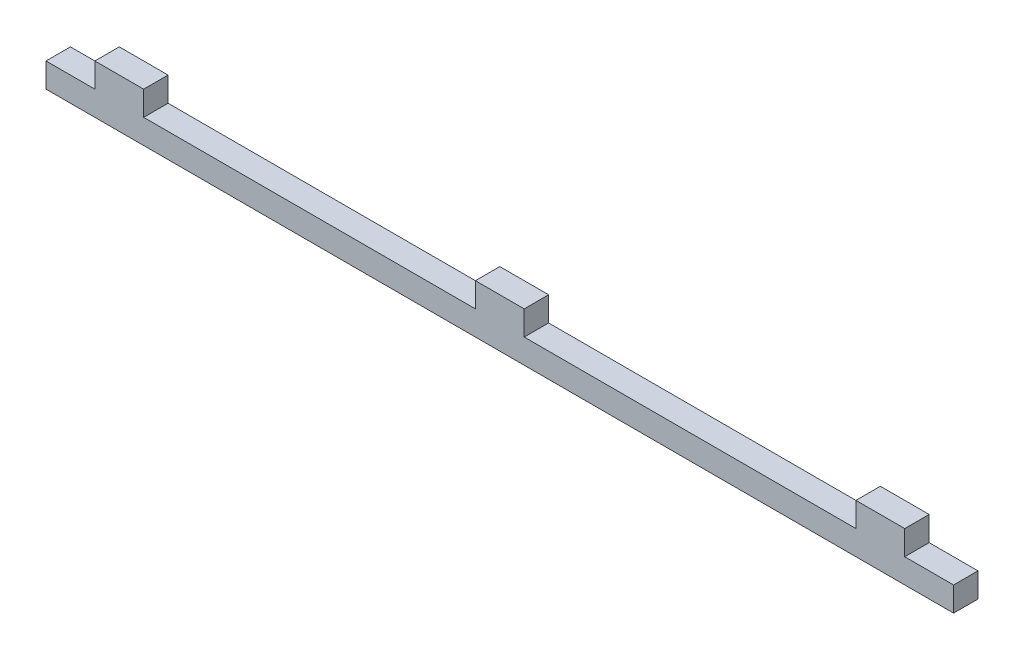
ISO-10303-21;
HEADER;
FILE_DESCRIPTION(('STEP AP214'),'2;1');
FILE_NAME('part.step','',(''),(''),'','','');
FILE_SCHEMA(('AUTOMOTIVE_DESIGN { 1 0 10303 214 1 1 1 1 }'));
ENDSEC;
DATA;
#1=APPLICATION_CONTEXT('core data for automotive mechanical design processes');
#2=APPLICATION_PROTOCOL_DEFINITION('international standard','automotive_design',2000,#1);
#3=PRODUCT_CONTEXT('',#1,'mechanical');
#4=PRODUCT('Part','Part','',(#3));
#5=PRODUCT_RELATED_PRODUCT_CATEGORY('part','',(#4));
#6=PRODUCT_DEFINITION_FORMATION('','',#4);
#7=PRODUCT_DEFINITION_CONTEXT('part definition',#1,'design');
#8=PRODUCT_DEFINITION('design','',#6,#7);
#9=PRODUCT_DEFINITION_SHAPE('','',#8);
#10=(LENGTH_UNIT() NAMED_UNIT(*) SI_UNIT(.MILLI.,.METRE.));
#11=(NAMED_UNIT(*) PLANE_ANGLE_UNIT() SI_UNIT($,.RADIAN.));
#12=(NAMED_UNIT(*) SI_UNIT($,.STERADIAN.) SOLID_ANGLE_UNIT());
#13=UNCERTAINTY_MEASURE_WITH_UNIT(LENGTH_MEASURE(1.E-05),#10,'distance_accuracy_value','');
#14=(GEOMETRIC_REPRESENTATION_CONTEXT(3) GLOBAL_UNCERTAINTY_ASSIGNED_CONTEXT((#13)) GLOBAL_UNIT_ASSIGNED_CONTEXT((#10,
#11,#12)) REPRESENTATION_CONTEXT('',''));
#15=CARTESIAN_POINT('',(0.,0.,0.));
#16=DIRECTION('',(0.,0.,1.));
#17=DIRECTION('',(1.,0.,0.));
#18=AXIS2_PLACEMENT_3D('',#15,#16,#17);
#19=CARTESIAN_POINT('',(-99.4999999999998,0.,-6.));
#20=DIRECTION('',(1.,0.,0.));
#21=DIRECTION('',(0.,0.,-1.));
#22=AXIS2_PLACEMENT_3D('',#19,#20,#21);
#23=PLANE('',#22);
#24=DIRECTION('',(0.,1.,0.));
#25=VECTOR('',#24,1.);
#26=CARTESIAN_POINT('',(-99.4999999999998,0.,0.));
#27=LINE('',#26,#25);
#28=CARTESIAN_POINT('',(-99.4999999999998,3.,0.));
#29=VERTEX_POINT('',#28);
#30=CARTESIAN_POINT('',(-99.4999999999998,9.,0.));
#31=VERTEX_POINT('',#30);
#32=EDGE_CURVE('E184',#29,#31,#27,.T.);
#33=ORIENTED_EDGE('',*,*,#32,.T.);
#34=DIRECTION('',(0.,0.,1.));
#35=VECTOR('',#34,1.);
#36=CARTESIAN_POINT('',(-99.4999999999998,9.,-6.));
#37=LINE('',#36,#35);
#38=CARTESIAN_POINT('',(-99.4999999999998,9.,-6.));
#39=VERTEX_POINT('',#38);
#40=EDGE_CURVE('E11',#39,#31,#37,.T.);
#41=ORIENTED_EDGE('',*,*,#40,.F.);
#42=DIRECTION('',(0.,1.,0.));
#43=VECTOR('',#42,1.);
#44=CARTESIAN_POINT('',(-99.4999999999998,0.,-6.));
#45=LINE('',#44,#43);
#46=CARTESIAN_POINT('',(-99.4999999999998,3.,-6.));
#47=VERTEX_POINT('',#46);
#48=EDGE_CURVE('E217',#47,#39,#45,.T.);
#49=ORIENTED_EDGE('',*,*,#48,.F.);
#50=DIRECTION('',(0.,0.,1.));
#51=VECTOR('',#50,1.);
#52=CARTESIAN_POINT('',(-99.4999999999998,3.,-6.));
#53=LINE('',#52,#51);
#54=EDGE_CURVE('E44',#47,#29,#53,.T.);
#55=ORIENTED_EDGE('',*,*,#54,.T.);
#56=EDGE_LOOP('',(#33,#41,#49,#55));
#57=FACE_BOUND('',#56,.T.);
#58=ADVANCED_FACE('F41',(#57),#23,.F.);
#59=CARTESIAN_POINT('',(0.,9.,-6.));
#60=DIRECTION('',(0.,-1.,0.));
#61=DIRECTION('',(0.,0.,-1.));
#62=AXIS2_PLACEMENT_3D('',#59,#60,#61);
#63=PLANE('',#62);
#64=DIRECTION('',(1.,0.,0.));
#65=VECTOR('',#64,1.);
#66=CARTESIAN_POINT('',(0.,9.,0.));
#67=LINE('',#66,#65);
#68=CARTESIAN_POINT('',(-87.4999999999998,9.,0.));
#69=VERTEX_POINT('',#68);
#70=EDGE_CURVE('E116',#31,#69,#67,.T.);
#71=ORIENTED_EDGE('',*,*,#70,.T.);
#72=DIRECTION('',(0.,0.,1.));
#73=VECTOR('',#72,1.);
#74=CARTESIAN_POINT('',(-87.4999999999998,9.,-6.));
#75=LINE('',#74,#73);
#76=CARTESIAN_POINT('',(-87.4999999999998,9.,-6.));
#77=VERTEX_POINT('',#76);
#78=EDGE_CURVE('E50',#77,#69,#75,.T.);
#79=ORIENTED_EDGE('',*,*,#78,.F.);
#80=DIRECTION('',(1.,0.,0.));
#81=VECTOR('',#80,1.);
#82=CARTESIAN_POINT('',(0.,9.,-6.));
#83=LINE('',#82,#81);
#84=EDGE_CURVE('E58',#39,#77,#83,.T.);
#85=ORIENTED_EDGE('',*,*,#84,.F.);
#86=ORIENTED_EDGE('',*,*,#40,.T.);
#87=EDGE_LOOP('',(#71,#79,#85,#86));
#88=FACE_BOUND('',#87,.T.);
#89=ADVANCED_FACE('F277',(#88),#63,.F.);
#90=CARTESIAN_POINT('',(-87.4999999999998,0.,-6.));
#91=DIRECTION('',(1.,0.,0.));
#92=DIRECTION('',(0.,0.,-1.));
#93=AXIS2_PLACEMENT_3D('',#90,#91,#92);
#94=PLANE('',#93);
#95=DIRECTION('',(0.,1.,0.));
#96=VECTOR('',#95,1.);
#97=CARTESIAN_POINT('',(-87.4999999999998,0.,0.));
#98=LINE('',#97,#96);
#99=CARTESIAN_POINT('',(-87.4999999999998,3.,0.));
#100=VERTEX_POINT('',#99);
#101=EDGE_CURVE('E165',#100,#69,#98,.T.);
#102=ORIENTED_EDGE('',*,*,#101,.F.);
#103=DIRECTION('',(0.,0.,1.));
#104=VECTOR('',#103,1.);
#105=CARTESIAN_POINT('',(-87.4999999999998,3.,-6.));
#106=LINE('',#105,#104);
#107=CARTESIAN_POINT('',(-87.4999999999998,3.,-6.));
#108=VERTEX_POINT('',#107);
#109=EDGE_CURVE('E160',#108,#100,#106,.T.);
#110=ORIENTED_EDGE('',*,*,#109,.F.);
#111=DIRECTION('',(0.,1.,0.));
#112=VECTOR('',#111,1.);
#113=CARTESIAN_POINT('',(-87.4999999999998,0.,-6.));
#114=LINE('',#113,#112);
#115=EDGE_CURVE('E164',#108,#77,#114,.T.);
#116=ORIENTED_EDGE('',*,*,#115,.T.);
#117=ORIENTED_EDGE('',*,*,#78,.T.);
#118=EDGE_LOOP('',(#102,#110,#116,#117));
#119=FACE_BOUND('',#118,.T.);
#120=ADVANCED_FACE('F162',(#119),#94,.T.);
#121=CARTESIAN_POINT('',(0.,3.,-6.));
#122=DIRECTION('',(0.,-1.,0.));
#123=DIRECTION('',(0.,0.,-1.));
#124=AXIS2_PLACEMENT_3D('',#121,#122,#123);
#125=PLANE('',#124);
#126=DIRECTION('',(1.,0.,0.));
#127=VECTOR('',#126,1.);
#128=CARTESIAN_POINT('',(0.,3.,0.));
#129=LINE('',#128,#127);
#130=CARTESIAN_POINT('',(-5.99999999999994,3.,0.));
#131=VERTEX_POINT('',#130);
#132=EDGE_CURVE('E190',#100,#131,#129,.T.);
#133=ORIENTED_EDGE('',*,*,#132,.T.);
#134=DIRECTION('',(0.,0.,1.));
#135=VECTOR('',#134,1.);
#136=CARTESIAN_POINT('',(-5.99999999999994,3.,-6.));
#137=LINE('',#136,#135);
#138=CARTESIAN_POINT('',(-5.99999999999994,3.,-6.));
#139=VERTEX_POINT('',#138);
#140=EDGE_CURVE('E168',#139,#131,#137,.T.);
#141=ORIENTED_EDGE('',*,*,#140,.F.);
#142=DIRECTION('',(1.,0.,0.));
#143=VECTOR('',#142,1.);
#144=CARTESIAN_POINT('',(0.,3.,-6.));
#145=LINE('',#144,#143);
#146=EDGE_CURVE('E171',#108,#139,#145,.T.);
#147=ORIENTED_EDGE('',*,*,#146,.F.);
#148=ORIENTED_EDGE('',*,*,#109,.T.);
#149=EDGE_LOOP('',(#133,#141,#147,#148));
#150=FACE_BOUND('',#149,.T.);
#151=ADVANCED_FACE('F172',(#150),#125,.F.);
#152=CARTESIAN_POINT('',(-5.99999999999994,0.,-6.));
#153=DIRECTION('',(1.,0.,0.));
#154=DIRECTION('',(0.,0.,-1.));
#155=AXIS2_PLACEMENT_3D('',#152,#153,#154);
#156=PLANE('',#155);
#157=DIRECTION('',(0.,1.,0.));
#158=VECTOR('',#157,1.);
#159=CARTESIAN_POINT('',(-5.99999999999994,0.,0.));
#160=LINE('',#159,#158);
#161=CARTESIAN_POINT('',(-5.99999999999994,9.,0.));
#162=VERTEX_POINT('',#161);
#163=EDGE_CURVE('E214',#131,#162,#160,.T.);
#164=ORIENTED_EDGE('',*,*,#163,.T.);
#165=DIRECTION('',(0.,0.,1.));
#166=VECTOR('',#165,1.);
#167=CARTESIAN_POINT('',(-5.99999999999994,9.,-6.));
#168=LINE('',#167,#166);
#169=CARTESIAN_POINT('',(-5.99999999999994,9.,-6.));
#170=VERTEX_POINT('',#169);
#171=EDGE_CURVE('E221',#170,#162,#168,.T.);
#172=ORIENTED_EDGE('',*,*,#171,.F.);
#173=DIRECTION('',(0.,1.,0.));
#174=VECTOR('',#173,1.);
#175=CARTESIAN_POINT('',(-5.99999999999994,0.,-6.));
#176=LINE('',#175,#174);
#177=EDGE_CURVE('E175',#139,#170,#176,.T.);
#178=ORIENTED_EDGE('',*,*,#177,.F.);
#179=ORIENTED_EDGE('',*,*,#140,.T.);
#180=EDGE_LOOP('',(#164,#172,#178,#179));
#181=FACE_BOUND('',#180,.T.);
#182=ADVANCED_FACE('F275',(#181),#156,.F.);
#183=CARTESIAN_POINT('',(0.,9.,-6.));
#184=DIRECTION('',(0.,-1.,0.));
#185=DIRECTION('',(0.,0.,-1.));
#186=AXIS2_PLACEMENT_3D('',#183,#184,#185);
#187=PLANE('',#186);
#188=DIRECTION('',(1.,0.,0.));
#189=VECTOR('',#188,1.);
#190=CARTESIAN_POINT('',(0.,9.,0.));
#191=LINE('',#190,#189);
#192=CARTESIAN_POINT('',(6.00000000000005,9.,0.));
#193=VERTEX_POINT('',#192);
#194=EDGE_CURVE('E211',#162,#193,#191,.T.);
#195=ORIENTED_EDGE('',*,*,#194,.T.);
#196=DIRECTION('',(0.,0.,1.));
#197=VECTOR('',#196,1.);
#198=CARTESIAN_POINT('',(6.00000000000005,9.,-6.));
#199=LINE('',#198,#197);
#200=CARTESIAN_POINT('',(6.00000000000005,9.,-6.));
#201=VERTEX_POINT('',#200);
#202=EDGE_CURVE('E224',#201,#193,#199,.T.);
#203=ORIENTED_EDGE('',*,*,#202,.F.);
#204=DIRECTION('',(1.,0.,0.));
#205=VECTOR('',#204,1.);
#206=CARTESIAN_POINT('',(0.,9.,-6.));
#207=LINE('',#206,#205);
#208=EDGE_CURVE('E513',#170,#201,#207,.T.);
#209=ORIENTED_EDGE('',*,*,#208,.F.);
#210=ORIENTED_EDGE('',*,*,#171,.T.);
#211=EDGE_LOOP('',(#195,#203,#209,#210));
#212=FACE_BOUND('',#211,.T.);
#213=ADVANCED_FACE('F388',(#212),#187,.F.);
#214=CARTESIAN_POINT('',(6.00000000000005,0.,-6.));
#215=DIRECTION('',(1.,0.,0.));
#216=DIRECTION('',(0.,0.,-1.));
#217=AXIS2_PLACEMENT_3D('',#214,#215,#216);
#218=PLANE('',#217);
#219=DIRECTION('',(0.,1.,0.));
#220=VECTOR('',#219,1.);
#221=CARTESIAN_POINT('',(6.00000000000005,0.,0.));
#222=LINE('',#221,#220);
#223=CARTESIAN_POINT('',(6.00000000000005,3.,0.));
#224=VERTEX_POINT('',#223);
#225=EDGE_CURVE('E208',#224,#193,#222,.T.);
#226=ORIENTED_EDGE('',*,*,#225,.F.);
#227=DIRECTION('',(0.,0.,1.));
#228=VECTOR('',#227,1.);
#229=CARTESIAN_POINT('',(6.00000000000005,3.,-6.));
#230=LINE('',#229,#228);
#231=CARTESIAN_POINT('',(6.00000000000005,3.,-6.));
#232=VERTEX_POINT('',#231);
#233=EDGE_CURVE('E226',#232,#224,#230,.T.);
#234=ORIENTED_EDGE('',*,*,#233,.F.);
#235=DIRECTION('',(0.,1.,0.));
#236=VECTOR('',#235,1.);
#237=CARTESIAN_POINT('',(6.00000000000005,0.,-6.));
#238=LINE('',#237,#236);
#239=EDGE_CURVE('E520',#232,#201,#238,.T.);
#240=ORIENTED_EDGE('',*,*,#239,.T.);
#241=ORIENTED_EDGE('',*,*,#202,.T.);
#242=EDGE_LOOP('',(#226,#234,#240,#241));
#243=FACE_BOUND('',#242,.T.);
#244=ADVANCED_FACE('F378',(#243),#218,.T.);
#245=CARTESIAN_POINT('',(87.5000000000001,3.,0.));
#246=VERTEX_POINT('',#245);
#247=EDGE_CURVE('E207',#224,#246,#129,.T.);
#248=ORIENTED_EDGE('',*,*,#247,.T.);
#249=DIRECTION('',(0.,0.,1.));
#250=VECTOR('',#249,1.);
#251=CARTESIAN_POINT('',(87.5000000000001,3.,-6.));
#252=LINE('',#251,#250);
#253=CARTESIAN_POINT('',(87.5000000000001,3.,-6.));
#254=VERTEX_POINT('',#253);
#255=EDGE_CURVE('E228',#254,#246,#252,.T.);
#256=ORIENTED_EDGE('',*,*,#255,.F.);
#257=EDGE_CURVE('E177',#232,#254,#145,.T.);
#258=ORIENTED_EDGE('',*,*,#257,.F.);
#259=ORIENTED_EDGE('',*,*,#233,.T.);
#260=EDGE_LOOP('',(#248,#256,#258,#259));
#261=FACE_BOUND('',#260,.T.);
#262=ADVANCED_FACE('F273',(#261),#125,.F.);
#263=CARTESIAN_POINT('',(87.5000000000001,0.,-6.));
#264=DIRECTION('',(1.,0.,0.));
#265=DIRECTION('',(0.,0.,-1.));
#266=AXIS2_PLACEMENT_3D('',#263,#264,#265);
#267=PLANE('',#266);
#268=DIRECTION('',(0.,1.,0.));
#269=VECTOR('',#268,1.);
#270=CARTESIAN_POINT('',(87.5000000000001,0.,0.));
#271=LINE('',#270,#269);
#272=CARTESIAN_POINT('',(87.5000000000001,9.,0.));
#273=VERTEX_POINT('',#272);
#274=EDGE_CURVE('E205',#246,#273,#271,.T.);
#275=ORIENTED_EDGE('',*,*,#274,.T.);
#276=DIRECTION('',(0.,0.,1.));
#277=VECTOR('',#276,1.);
#278=CARTESIAN_POINT('',(87.5000000000001,9.,-6.));
#279=LINE('',#278,#277);
#280=CARTESIAN_POINT('',(87.5000000000001,9.,-6.));
#281=VERTEX_POINT('',#280);
#282=EDGE_CURVE('E231',#281,#273,#279,.T.);
#283=ORIENTED_EDGE('',*,*,#282,.F.);
#284=DIRECTION('',(0.,1.,0.));
#285=VECTOR('',#284,1.);
#286=CARTESIAN_POINT('',(87.5000000000001,0.,-6.));
#287=LINE('',#286,#285);
#288=EDGE_CURVE('E522',#254,#281,#287,.T.);
#289=ORIENTED_EDGE('',*,*,#288,.F.);
#290=ORIENTED_EDGE('',*,*,#255,.T.);
#291=EDGE_LOOP('',(#275,#283,#289,#290));
#292=FACE_BOUND('',#291,.T.);
#293=ADVANCED_FACE('F357',(#292),#267,.F.);
#294=CARTESIAN_POINT('',(0.,9.,-6.));
#295=DIRECTION('',(0.,-1.,0.));
#296=DIRECTION('',(0.,0.,-1.));
#297=AXIS2_PLACEMENT_3D('',#294,#295,#296);
#298=PLANE('',#297);
#299=DIRECTION('',(1.,0.,0.));
#300=VECTOR('',#299,1.);
#301=CARTESIAN_POINT('',(0.,9.,0.));
#302=LINE('',#301,#300);
#303=CARTESIAN_POINT('',(99.5000000000001,9.,0.));
#304=VERTEX_POINT('',#303);
#305=EDGE_CURVE('E202',#273,#304,#302,.T.);
#306=ORIENTED_EDGE('',*,*,#305,.T.);
#307=DIRECTION('',(0.,0.,1.));
#308=VECTOR('',#307,1.);
#309=CARTESIAN_POINT('',(99.5000000000001,9.,-6.));
#310=LINE('',#309,#308);
#311=CARTESIAN_POINT('',(99.5000000000001,9.,-6.));
#312=VERTEX_POINT('',#311);
#313=EDGE_CURVE('E234',#312,#304,#310,.T.);
#314=ORIENTED_EDGE('',*,*,#313,.F.);
#315=DIRECTION('',(1.,0.,0.));
#316=VECTOR('',#315,1.);
#317=CARTESIAN_POINT('',(0.,9.,-6.));
#318=LINE('',#317,#316);
#319=EDGE_CURVE('E526',#281,#312,#318,.T.);
#320=ORIENTED_EDGE('',*,*,#319,.F.);
#321=ORIENTED_EDGE('',*,*,#282,.T.);
#322=EDGE_LOOP('',(#306,#314,#320,#321));
#323=FACE_BOUND('',#322,.T.);
#324=ADVANCED_FACE('F345',(#323),#298,.F.);
#325=CARTESIAN_POINT('',(99.5000000000001,0.,-6.));
#326=DIRECTION('',(1.,0.,0.));
#327=DIRECTION('',(0.,0.,-1.));
#328=AXIS2_PLACEMENT_3D('',#325,#326,#327);
#329=PLANE('',#328);
#330=DIRECTION('',(0.,1.,0.));
#331=VECTOR('',#330,1.);
#332=CARTESIAN_POINT('',(99.5000000000001,0.,0.));
#333=LINE('',#332,#331);
#334=CARTESIAN_POINT('',(99.5000000000001,3.,0.));
#335=VERTEX_POINT('',#334);
#336=EDGE_CURVE('E199',#335,#304,#333,.T.);
#337=ORIENTED_EDGE('',*,*,#336,.F.);
#338=DIRECTION('',(0.,0.,1.));
#339=VECTOR('',#338,1.);
#340=CARTESIAN_POINT('',(99.5000000000001,3.,-6.));
#341=LINE('',#340,#339);
#342=CARTESIAN_POINT('',(99.5000000000001,3.,-6.));
#343=VERTEX_POINT('',#342);
#344=EDGE_CURVE('E236',#343,#335,#341,.T.);
#345=ORIENTED_EDGE('',*,*,#344,.F.);
#346=DIRECTION('',(0.,1.,0.));
#347=VECTOR('',#346,1.);
#348=CARTESIAN_POINT('',(99.5000000000001,0.,-6.));
#349=LINE('',#348,#347);
#350=EDGE_CURVE('E528',#343,#312,#349,.T.);
#351=ORIENTED_EDGE('',*,*,#350,.T.);
#352=ORIENTED_EDGE('',*,*,#313,.T.);
#353=EDGE_LOOP('',(#337,#345,#351,#352));
#354=FACE_BOUND('',#353,.T.);
#355=ADVANCED_FACE('F271',(#354),#329,.T.);
#356=CARTESIAN_POINT('',(111.5,3.,0.));
#357=VERTEX_POINT('',#356);
#358=EDGE_CURVE('E191',#335,#357,#129,.T.);
#359=ORIENTED_EDGE('',*,*,#358,.T.);
#360=DIRECTION('',(0.,0.,1.));
#361=VECTOR('',#360,1.);
#362=CARTESIAN_POINT('',(111.5,3.,-6.));
#363=LINE('',#362,#361);
#364=CARTESIAN_POINT('',(111.5,3.,-6.));
#365=VERTEX_POINT('',#364);
#366=EDGE_CURVE('E238',#365,#357,#363,.T.);
#367=ORIENTED_EDGE('',*,*,#366,.F.);
#368=EDGE_CURVE('E523',#343,#365,#145,.T.);
#369=ORIENTED_EDGE('',*,*,#368,.F.);
#370=ORIENTED_EDGE('',*,*,#344,.T.);
#371=EDGE_LOOP('',(#359,#367,#369,#370));
#372=FACE_BOUND('',#371,.T.);
#373=ADVANCED_FACE('F259',(#372),#125,.F.);
#374=CARTESIAN_POINT('',(111.5,0.,-6.));
#375=DIRECTION('',(1.,0.,0.));
#376=DIRECTION('',(0.,0.,-1.));
#377=AXIS2_PLACEMENT_3D('',#374,#375,#376);
#378=PLANE('',#377);
#379=DIRECTION('',(0.,1.,0.));
#380=VECTOR('',#379,1.);
#381=CARTESIAN_POINT('',(111.5,0.,0.));
#382=LINE('',#381,#380);
#383=CARTESIAN_POINT('',(111.5,-3.,0.));
#384=VERTEX_POINT('',#383);
#385=EDGE_CURVE('E196',#384,#357,#382,.T.);
#386=ORIENTED_EDGE('',*,*,#385,.F.);
#387=DIRECTION('',(0.,0.,1.));
#388=VECTOR('',#387,1.);
#389=CARTESIAN_POINT('',(111.5,-3.,-6.));
#390=LINE('',#389,#388);
#391=CARTESIAN_POINT('',(111.5,-3.,-6.));
#392=VERTEX_POINT('',#391);
#393=EDGE_CURVE('E240',#392,#384,#390,.T.);
#394=ORIENTED_EDGE('',*,*,#393,.F.);
#395=DIRECTION('',(0.,1.,0.));
#396=VECTOR('',#395,1.);
#397=CARTESIAN_POINT('',(111.5,0.,-6.));
#398=LINE('',#397,#396);
#399=EDGE_CURVE('E531',#392,#365,#398,.T.);
#400=ORIENTED_EDGE('',*,*,#399,.T.);
#401=ORIENTED_EDGE('',*,*,#366,.T.);
#402=EDGE_LOOP('',(#386,#394,#400,#401));
#403=FACE_BOUND('',#402,.T.);
#404=ADVANCED_FACE('F270',(#403),#378,.T.);
#405=CARTESIAN_POINT('',(0.,-3.,-6.));
#406=DIRECTION('',(0.,-1.,0.));
#407=DIRECTION('',(1.,0.,0.));
#408=AXIS2_PLACEMENT_3D('',#405,#406,#407);
#409=PLANE('',#408);
#410=DIRECTION('',(1.,0.,0.));
#411=VECTOR('',#410,1.);
#412=CARTESIAN_POINT('',(0.,-3.,0.));
#413=LINE('',#412,#411);
#414=CARTESIAN_POINT('',(-111.5,-3.,0.));
#415=VERTEX_POINT('',#414);
#416=EDGE_CURVE('E193',#415,#384,#413,.T.);
#417=ORIENTED_EDGE('',*,*,#416,.F.);
#418=DIRECTION('',(0.,0.,1.));
#419=VECTOR('',#418,1.);
#420=CARTESIAN_POINT('',(-111.5,-3.,-6.));
#421=LINE('',#420,#419);
#422=CARTESIAN_POINT('',(-111.5,-3.,-6.));
#423=VERTEX_POINT('',#422);
#424=EDGE_CURVE('E242',#423,#415,#421,.T.);
#425=ORIENTED_EDGE('',*,*,#424,.F.);
#426=DIRECTION('',(1.,0.,0.));
#427=VECTOR('',#426,1.);
#428=CARTESIAN_POINT('',(0.,-3.,-6.));
#429=LINE('',#428,#427);
#430=EDGE_CURVE('E534',#423,#392,#429,.T.);
#431=ORIENTED_EDGE('',*,*,#430,.T.);
#432=ORIENTED_EDGE('',*,*,#393,.T.);
#433=EDGE_LOOP('',(#417,#425,#431,#432));
#434=FACE_BOUND('',#433,.T.);
#435=ADVANCED_FACE('F265',(#434),#409,.T.);
#436=CARTESIAN_POINT('',(-111.5,0.,-6.));
#437=DIRECTION('',(1.,0.,0.));
#438=DIRECTION('',(0.,0.,-1.));
#439=AXIS2_PLACEMENT_3D('',#436,#437,#438);
#440=PLANE('',#439);
#441=DIRECTION('',(0.,1.,0.));
#442=VECTOR('',#441,1.);
#443=CARTESIAN_POINT('',(-111.5,0.,0.));
#444=LINE('',#443,#442);
#445=CARTESIAN_POINT('',(-111.5,3.,0.));
#446=VERTEX_POINT('',#445);
#447=EDGE_CURVE('E189',#415,#446,#444,.T.);
#448=ORIENTED_EDGE('',*,*,#447,.T.);
#449=DIRECTION('',(0.,0.,1.));
#450=VECTOR('',#449,1.);
#451=CARTESIAN_POINT('',(-111.5,3.,-6.));
#452=LINE('',#451,#450);
#453=CARTESIAN_POINT('',(-111.5,3.,-6.));
#454=VERTEX_POINT('',#453);
#455=EDGE_CURVE('E243',#454,#446,#452,.T.);
#456=ORIENTED_EDGE('',*,*,#455,.F.);
#457=DIRECTION('',(0.,1.,0.));
#458=VECTOR('',#457,1.);
#459=CARTESIAN_POINT('',(-111.5,0.,-6.));
#460=LINE('',#459,#458);
#461=EDGE_CURVE('E537',#423,#454,#460,.T.);
#462=ORIENTED_EDGE('',*,*,#461,.F.);
#463=ORIENTED_EDGE('',*,*,#424,.T.);
#464=EDGE_LOOP('',(#448,#456,#462,#463));
#465=FACE_BOUND('',#464,.T.);
#466=ADVANCED_FACE('F257',(#465),#440,.F.);
#467=EDGE_CURVE('E187',#446,#29,#129,.T.);
#468=ORIENTED_EDGE('',*,*,#467,.T.);
#469=ORIENTED_EDGE('',*,*,#54,.F.);
#470=EDGE_CURVE('E123',#454,#47,#145,.T.);
#471=ORIENTED_EDGE('',*,*,#470,.F.);
#472=ORIENTED_EDGE('',*,*,#455,.T.);
#473=EDGE_LOOP('',(#468,#469,#471,#472));
#474=FACE_BOUND('',#473,.T.);
#475=ADVANCED_FACE('F255',(#474),#125,.F.);
#476=CARTESIAN_POINT('',(0.,0.,-6.));
#477=DIRECTION('',(0.,0.,1.));
#478=DIRECTION('',(1.,0.,0.));
#479=AXIS2_PLACEMENT_3D('',#476,#477,#478);
#480=PLANE('',#479);
#481=ORIENTED_EDGE('',*,*,#48,.T.);
#482=ORIENTED_EDGE('',*,*,#84,.T.);
#483=ORIENTED_EDGE('',*,*,#115,.F.);
#484=ORIENTED_EDGE('',*,*,#146,.T.);
#485=ORIENTED_EDGE('',*,*,#177,.T.);
#486=ORIENTED_EDGE('',*,*,#208,.T.);
#487=ORIENTED_EDGE('',*,*,#239,.F.);
#488=ORIENTED_EDGE('',*,*,#257,.T.);
#489=ORIENTED_EDGE('',*,*,#288,.T.);
#490=ORIENTED_EDGE('',*,*,#319,.T.);
#491=ORIENTED_EDGE('',*,*,#350,.F.);
#492=ORIENTED_EDGE('',*,*,#368,.T.);
#493=ORIENTED_EDGE('',*,*,#399,.F.);
#494=ORIENTED_EDGE('',*,*,#430,.F.);
#495=ORIENTED_EDGE('',*,*,#461,.T.);
#496=ORIENTED_EDGE('',*,*,#470,.T.);
#497=EDGE_LOOP('',(#481,#482,#483,#484,#485,#486,#487,#488,#489,#490,#491,#492,#493,#494,#495,#496));
#498=FACE_BOUND('',#497,.T.);
#499=ADVANCED_FACE('F178',(#498),#480,.F.);
#500=CARTESIAN_POINT('',(0.,0.,0.));
#501=DIRECTION('',(0.,0.,1.));
#502=DIRECTION('',(1.,0.,0.));
#503=AXIS2_PLACEMENT_3D('',#500,#501,#502);
#504=PLANE('',#503);
#505=ORIENTED_EDGE('',*,*,#32,.F.);
#506=ORIENTED_EDGE('',*,*,#467,.F.);
#507=ORIENTED_EDGE('',*,*,#447,.F.);
#508=ORIENTED_EDGE('',*,*,#416,.T.);
#509=ORIENTED_EDGE('',*,*,#385,.T.);
#510=ORIENTED_EDGE('',*,*,#358,.F.);
#511=ORIENTED_EDGE('',*,*,#336,.T.);
#512=ORIENTED_EDGE('',*,*,#305,.F.);
#513=ORIENTED_EDGE('',*,*,#274,.F.);
#514=ORIENTED_EDGE('',*,*,#247,.F.);
#515=ORIENTED_EDGE('',*,*,#225,.T.);
#516=ORIENTED_EDGE('',*,*,#194,.F.);
#517=ORIENTED_EDGE('',*,*,#163,.F.);
#518=ORIENTED_EDGE('',*,*,#132,.F.);
#519=ORIENTED_EDGE('',*,*,#101,.T.);
#520=ORIENTED_EDGE('',*,*,#70,.F.);
#521=EDGE_LOOP('',(#505,#506,#507,#508,#509,#510,#511,#512,#513,#514,#515,#516,#517,#518,#519,#520));
#522=FACE_BOUND('',#521,.T.);
#523=ADVANCED_FACE('F252',(#522),#504,.T.);
#524=CLOSED_SHELL('',(#58,#89,#120,#151,#182,#213,#244,#262,#293,#324,#355,#373,#404,#435,#466,
#475,#499,#523));
#525=MANIFOLD_SOLID_BREP('B2',#524);
#526=ADVANCED_BREP_SHAPE_REPRESENTATION('',(#18,#525),#14);
#527=SHAPE_DEFINITION_REPRESENTATION(#9,#526);
ENDSEC;
END-ISO-10303-21;
